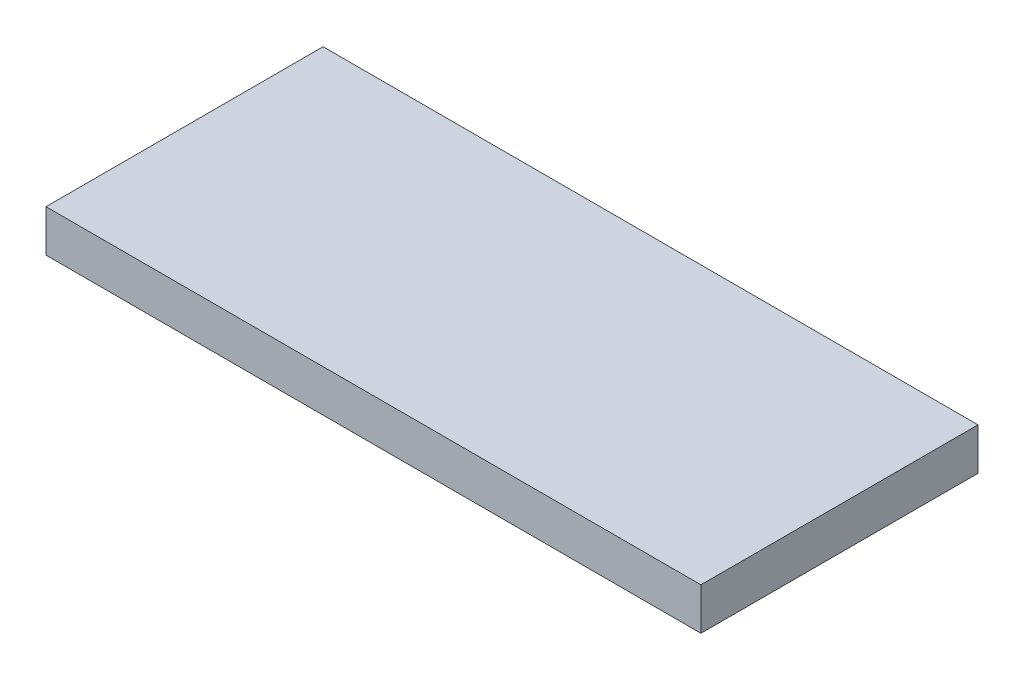
ISO-10303-21;
HEADER;
FILE_DESCRIPTION(('STEP AP214'),'2;1');
FILE_NAME('part.step','',(''),(''),'','','');
FILE_SCHEMA(('AUTOMOTIVE_DESIGN { 1 0 10303 214 1 1 1 1 }'));
ENDSEC;
DATA;
#1=APPLICATION_CONTEXT('core data for automotive mechanical design processes');
#2=APPLICATION_PROTOCOL_DEFINITION('international standard','automotive_design',2000,#1);
#3=PRODUCT_CONTEXT('',#1,'mechanical');
#4=PRODUCT('Part','Part','',(#3));
#5=PRODUCT_RELATED_PRODUCT_CATEGORY('part','',(#4));
#6=PRODUCT_DEFINITION_FORMATION('','',#4);
#7=PRODUCT_DEFINITION_CONTEXT('part definition',#1,'design');
#8=PRODUCT_DEFINITION('design','',#6,#7);
#9=PRODUCT_DEFINITION_SHAPE('','',#8);
#10=(LENGTH_UNIT() NAMED_UNIT(*) SI_UNIT(.MILLI.,.METRE.));
#11=(NAMED_UNIT(*) PLANE_ANGLE_UNIT() SI_UNIT($,.RADIAN.));
#12=(NAMED_UNIT(*) SI_UNIT($,.STERADIAN.) SOLID_ANGLE_UNIT());
#13=UNCERTAINTY_MEASURE_WITH_UNIT(LENGTH_MEASURE(1.E-05),#10,'distance_accuracy_value','');
#14=(GEOMETRIC_REPRESENTATION_CONTEXT(3) GLOBAL_UNCERTAINTY_ASSIGNED_CONTEXT((#13)) GLOBAL_UNIT_ASSIGNED_CONTEXT((#10,
#11,#12)) REPRESENTATION_CONTEXT('',''));
#15=CARTESIAN_POINT('',(0.,0.,0.));
#16=DIRECTION('',(0.,0.,1.));
#17=DIRECTION('',(1.,0.,0.));
#18=AXIS2_PLACEMENT_3D('',#15,#16,#17);
#19=CARTESIAN_POINT('',(0.,5.,0.));
#20=DIRECTION('',(1.,0.,0.));
#21=DIRECTION('',(0.,0.,-1.));
#22=AXIS2_PLACEMENT_3D('',#19,#20,#21);
#23=PLANE('',#22);
#24=DIRECTION('',(0.,0.,1.));
#25=VECTOR('',#24,1.);
#26=CARTESIAN_POINT('',(0.,0.,0.));
#27=LINE('',#26,#25);
#28=CARTESIAN_POINT('',(0.,0.,-33.));
#29=VERTEX_POINT('',#28);
#30=CARTESIAN_POINT('',(0.,0.,0.));
#31=VERTEX_POINT('',#30);
#32=EDGE_CURVE('E99',#29,#31,#27,.T.);
#33=ORIENTED_EDGE('',*,*,#32,.T.);
#34=DIRECTION('',(0.,-1.,0.));
#35=VECTOR('',#34,1.);
#36=CARTESIAN_POINT('',(0.,5.,0.));
#37=LINE('',#36,#35);
#38=CARTESIAN_POINT('',(0.,5.,0.));
#39=VERTEX_POINT('',#38);
#40=EDGE_CURVE('E11',#39,#31,#37,.T.);
#41=ORIENTED_EDGE('',*,*,#40,.F.);
#42=DIRECTION('',(0.,0.,1.));
#43=VECTOR('',#42,1.);
#44=CARTESIAN_POINT('',(0.,5.,0.));
#45=LINE('',#44,#43);
#46=CARTESIAN_POINT('',(0.,5.,-33.));
#47=VERTEX_POINT('',#46);
#48=EDGE_CURVE('E87',#47,#39,#45,.T.);
#49=ORIENTED_EDGE('',*,*,#48,.F.);
#50=DIRECTION('',(0.,-1.,0.));
#51=VECTOR('',#50,1.);
#52=CARTESIAN_POINT('',(0.,5.,-33.));
#53=LINE('',#52,#51);
#54=EDGE_CURVE('E95',#47,#29,#53,.T.);
#55=ORIENTED_EDGE('',*,*,#54,.T.);
#56=EDGE_LOOP('',(#33,#41,#49,#55));
#57=FACE_BOUND('',#56,.T.);
#58=ADVANCED_FACE('F36',(#57),#23,.F.);
#59=CARTESIAN_POINT('',(0.,5.,0.));
#60=DIRECTION('',(0.,0.,-1.));
#61=DIRECTION('',(-1.,0.,0.));
#62=AXIS2_PLACEMENT_3D('',#59,#60,#61);
#63=PLANE('',#62);
#64=DIRECTION('',(1.,0.,0.));
#65=VECTOR('',#64,1.);
#66=CARTESIAN_POINT('',(0.,0.,0.));
#67=LINE('',#66,#65);
#68=CARTESIAN_POINT('',(78.,0.,0.));
#69=VERTEX_POINT('',#68);
#70=EDGE_CURVE('E91',#31,#69,#67,.T.);
#71=ORIENTED_EDGE('',*,*,#70,.T.);
#72=DIRECTION('',(0.,-1.,0.));
#73=VECTOR('',#72,1.);
#74=CARTESIAN_POINT('',(78.,5.,0.));
#75=LINE('',#74,#73);
#76=CARTESIAN_POINT('',(78.,5.,0.));
#77=VERTEX_POINT('',#76);
#78=EDGE_CURVE('E44',#77,#69,#75,.T.);
#79=ORIENTED_EDGE('',*,*,#78,.F.);
#80=DIRECTION('',(1.,0.,0.));
#81=VECTOR('',#80,1.);
#82=CARTESIAN_POINT('',(0.,5.,0.));
#83=LINE('',#82,#81);
#84=EDGE_CURVE('E82',#39,#77,#83,.T.);
#85=ORIENTED_EDGE('',*,*,#84,.F.);
#86=ORIENTED_EDGE('',*,*,#40,.T.);
#87=EDGE_LOOP('',(#71,#79,#85,#86));
#88=FACE_BOUND('',#87,.T.);
#89=ADVANCED_FACE('F90',(#88),#63,.F.);
#90=CARTESIAN_POINT('',(78.,5.,0.));
#91=DIRECTION('',(-1.,0.,0.));
#92=DIRECTION('',(0.,0.,1.));
#93=AXIS2_PLACEMENT_3D('',#90,#91,#92);
#94=PLANE('',#93);
#95=DIRECTION('',(0.,0.,-1.));
#96=VECTOR('',#95,1.);
#97=CARTESIAN_POINT('',(78.,0.,0.));
#98=LINE('',#97,#96);
#99=CARTESIAN_POINT('',(78.,0.,-33.));
#100=VERTEX_POINT('',#99);
#101=EDGE_CURVE('E69',#69,#100,#98,.T.);
#102=ORIENTED_EDGE('',*,*,#101,.T.);
#103=DIRECTION('',(0.,-1.,0.));
#104=VECTOR('',#103,1.);
#105=CARTESIAN_POINT('',(78.,5.,-33.));
#106=LINE('',#105,#104);
#107=CARTESIAN_POINT('',(78.,5.,-33.));
#108=VERTEX_POINT('',#107);
#109=EDGE_CURVE('E92',#108,#100,#106,.T.);
#110=ORIENTED_EDGE('',*,*,#109,.F.);
#111=DIRECTION('',(0.,0.,-1.));
#112=VECTOR('',#111,1.);
#113=CARTESIAN_POINT('',(78.,5.,0.));
#114=LINE('',#113,#112);
#115=EDGE_CURVE('E85',#77,#108,#114,.T.);
#116=ORIENTED_EDGE('',*,*,#115,.F.);
#117=ORIENTED_EDGE('',*,*,#78,.T.);
#118=EDGE_LOOP('',(#102,#110,#116,#117));
#119=FACE_BOUND('',#118,.T.);
#120=ADVANCED_FACE('F93',(#119),#94,.F.);
#121=CARTESIAN_POINT('',(0.,5.,-33.));
#122=DIRECTION('',(0.,0.,1.));
#123=DIRECTION('',(1.,0.,0.));
#124=AXIS2_PLACEMENT_3D('',#121,#122,#123);
#125=PLANE('',#124);
#126=DIRECTION('',(-1.,0.,0.));
#127=VECTOR('',#126,1.);
#128=CARTESIAN_POINT('',(0.,0.,-33.));
#129=LINE('',#128,#127);
#130=EDGE_CURVE('E75',#100,#29,#129,.T.);
#131=ORIENTED_EDGE('',*,*,#130,.T.);
#132=ORIENTED_EDGE('',*,*,#54,.F.);
#133=DIRECTION('',(-1.,0.,0.));
#134=VECTOR('',#133,1.);
#135=CARTESIAN_POINT('',(0.,5.,-33.));
#136=LINE('',#135,#134);
#137=EDGE_CURVE('E52',#108,#47,#136,.T.);
#138=ORIENTED_EDGE('',*,*,#137,.F.);
#139=ORIENTED_EDGE('',*,*,#109,.T.);
#140=EDGE_LOOP('',(#131,#132,#138,#139));
#141=FACE_BOUND('',#140,.T.);
#142=ADVANCED_FACE('F106',(#141),#125,.F.);
#143=CARTESIAN_POINT('',(0.,5.,0.));
#144=DIRECTION('',(0.,-1.,0.));
#145=DIRECTION('',(0.,0.,-1.));
#146=AXIS2_PLACEMENT_3D('',#143,#144,#145);
#147=PLANE('',#146);
#148=ORIENTED_EDGE('',*,*,#48,.T.);
#149=ORIENTED_EDGE('',*,*,#84,.T.);
#150=ORIENTED_EDGE('',*,*,#115,.T.);
#151=ORIENTED_EDGE('',*,*,#137,.T.);
#152=EDGE_LOOP('',(#148,#149,#150,#151));
#153=FACE_BOUND('',#152,.T.);
#154=ADVANCED_FACE('F83',(#153),#147,.F.);
#155=CARTESIAN_POINT('',(0.,0.,0.));
#156=DIRECTION('',(0.,-1.,0.));
#157=DIRECTION('',(0.,0.,-1.));
#158=AXIS2_PLACEMENT_3D('',#155,#156,#157);
#159=PLANE('',#158);
#160=ORIENTED_EDGE('',*,*,#32,.F.);
#161=ORIENTED_EDGE('',*,*,#130,.F.);
#162=ORIENTED_EDGE('',*,*,#101,.F.);
#163=ORIENTED_EDGE('',*,*,#70,.F.);
#164=EDGE_LOOP('',(#160,#161,#162,#163));
#165=FACE_BOUND('',#164,.T.);
#166=ADVANCED_FACE('F109',(#165),#159,.T.);
#167=CLOSED_SHELL('',(#58,#89,#120,#142,#154,#166));
#168=MANIFOLD_SOLID_BREP('B2',#167);
#169=ADVANCED_BREP_SHAPE_REPRESENTATION('',(#18,#168),#14);
#170=SHAPE_DEFINITION_REPRESENTATION(#9,#169);
ENDSEC;
END-ISO-10303-21;
